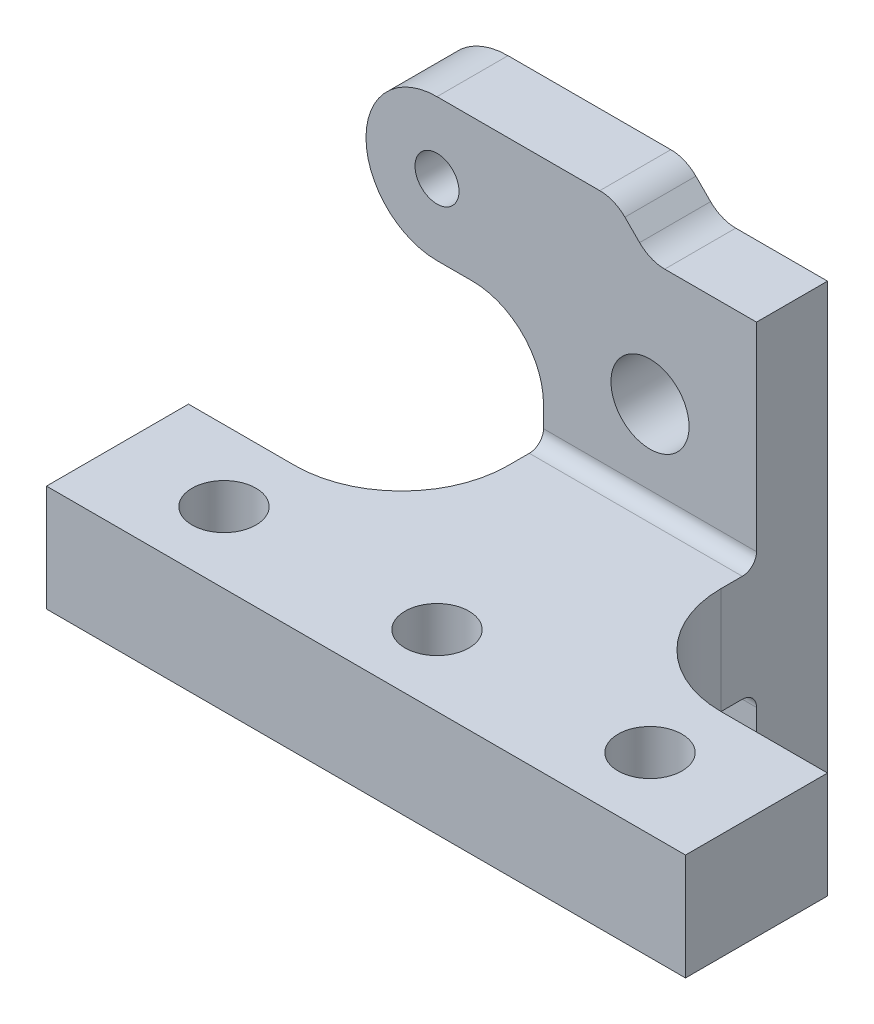
ISO-10303-21;
HEADER;
FILE_DESCRIPTION(('STEP AP214'),'2;1');
FILE_NAME('part.step','',(''),(''),'','','');
FILE_SCHEMA(('AUTOMOTIVE_DESIGN { 1 0 10303 214 1 1 1 1 }'));
ENDSEC;
DATA;
#1=APPLICATION_CONTEXT('core data for automotive mechanical design processes');
#2=APPLICATION_PROTOCOL_DEFINITION('international standard','automotive_design',2000,#1);
#3=PRODUCT_CONTEXT('',#1,'mechanical');
#4=PRODUCT('Part','Part','',(#3));
#5=PRODUCT_RELATED_PRODUCT_CATEGORY('part','',(#4));
#6=PRODUCT_DEFINITION_FORMATION('','',#4);
#7=PRODUCT_DEFINITION_CONTEXT('part definition',#1,'design');
#8=PRODUCT_DEFINITION('design','',#6,#7);
#9=PRODUCT_DEFINITION_SHAPE('','',#8);
#10=(LENGTH_UNIT() NAMED_UNIT(*) SI_UNIT(.MILLI.,.METRE.));
#11=(NAMED_UNIT(*) PLANE_ANGLE_UNIT() SI_UNIT($,.RADIAN.));
#12=(NAMED_UNIT(*) SI_UNIT($,.STERADIAN.) SOLID_ANGLE_UNIT());
#13=UNCERTAINTY_MEASURE_WITH_UNIT(LENGTH_MEASURE(1.E-05),#10,'distance_accuracy_value','');
#14=(GEOMETRIC_REPRESENTATION_CONTEXT(3) GLOBAL_UNCERTAINTY_ASSIGNED_CONTEXT((#13)) GLOBAL_UNIT_ASSIGNED_CONTEXT((#10,
#11,#12)) REPRESENTATION_CONTEXT('',''));
#15=CARTESIAN_POINT('',(0.,0.,0.));
#16=DIRECTION('',(0.,0.,1.));
#17=DIRECTION('',(1.,0.,0.));
#18=AXIS2_PLACEMENT_3D('',#15,#16,#17);
#19=CARTESIAN_POINT('',(-15.,-37.5,10.));
#20=DIRECTION('',(1.,0.,0.));
#21=DIRECTION('',(0.,0.,-1.));
#22=AXIS2_PLACEMENT_3D('',#19,#20,#21);
#23=PLANE('',#22);
#24=DIRECTION('',(0.,-1.,0.));
#25=VECTOR('',#24,1.);
#26=CARTESIAN_POINT('',(-15.,-37.5,10.));
#27=LINE('',#26,#25);
#28=CARTESIAN_POINT('',(-15.,12.5,10.));
#29=VERTEX_POINT('',#28);
#30=CARTESIAN_POINT('',(-15.,9.5,10.));
#31=VERTEX_POINT('',#30);
#32=EDGE_CURVE('E320',#29,#31,#27,.T.);
#33=ORIENTED_EDGE('',*,*,#32,.F.);
#34=DIRECTION('',(0.,0.,1.));
#35=VECTOR('',#34,1.);
#36=CARTESIAN_POINT('',(-15.,12.5,10.));
#37=LINE('',#36,#35);
#38=CARTESIAN_POINT('',(-15.,12.5,0.));
#39=VERTEX_POINT('',#38);
#40=EDGE_CURVE('E55',#29,#39,#37,.F.);
#41=ORIENTED_EDGE('',*,*,#40,.T.);
#42=DIRECTION('',(0.,-1.,0.));
#43=VECTOR('',#42,1.);
#44=CARTESIAN_POINT('',(-15.,-37.5,0.));
#45=LINE('',#44,#43);
#46=CARTESIAN_POINT('',(-15.,-37.5,0.));
#47=VERTEX_POINT('',#46);
#48=EDGE_CURVE('E330',#39,#47,#45,.T.);
#49=ORIENTED_EDGE('',*,*,#48,.T.);
#50=DIRECTION('',(0.,0.,-1.));
#51=VECTOR('',#50,1.);
#52=CARTESIAN_POINT('',(-15.,-37.5,10.));
#53=LINE('',#52,#51);
#54=CARTESIAN_POINT('',(-15.,-37.5,10.));
#55=VERTEX_POINT('',#54);
#56=EDGE_CURVE('E336',#55,#47,#53,.T.);
#57=ORIENTED_EDGE('',*,*,#56,.F.);
#58=CARTESIAN_POINT('',(-15.,-9.5,10.));
#59=VERTEX_POINT('',#58);
#60=EDGE_CURVE('E319',#59,#55,#27,.T.);
#61=ORIENTED_EDGE('',*,*,#60,.F.);
#62=CARTESIAN_POINT('',(-15.,-9.5,12.));
#63=DIRECTION('',(1.,0.,0.));
#64=DIRECTION('',(0.,0.,-1.));
#65=AXIS2_PLACEMENT_3D('',#62,#63,#64);
#66=CIRCLE('',#65,2.);
#67=CARTESIAN_POINT('',(-15.,-7.5,12.));
#68=VERTEX_POINT('',#67);
#69=EDGE_CURVE('E360',#59,#68,#66,.T.);
#70=ORIENTED_EDGE('',*,*,#69,.T.);
#71=DIRECTION('',(0.,0.,-1.));
#72=VECTOR('',#71,1.);
#73=CARTESIAN_POINT('',(-15.,-7.5,50.));
#74=LINE('',#73,#72);
#75=CARTESIAN_POINT('',(-15.,-7.5,15.));
#76=VERTEX_POINT('',#75);
#77=EDGE_CURVE('E293',#76,#68,#74,.T.);
#78=ORIENTED_EDGE('',*,*,#77,.F.);
#79=DIRECTION('',(0.,-1.,0.));
#80=VECTOR('',#79,1.);
#81=CARTESIAN_POINT('',(-15.,7.5,15.));
#82=LINE('',#81,#80);
#83=CARTESIAN_POINT('',(-15.,7.5,15.));
#84=VERTEX_POINT('',#83);
#85=EDGE_CURVE('E375',#76,#84,#82,.F.);
#86=ORIENTED_EDGE('',*,*,#85,.T.);
#87=DIRECTION('',(0.,0.,-1.));
#88=VECTOR('',#87,1.);
#89=CARTESIAN_POINT('',(-15.,7.5,50.));
#90=LINE('',#89,#88);
#91=CARTESIAN_POINT('',(-15.,7.5,12.));
#92=VERTEX_POINT('',#91);
#93=EDGE_CURVE('E295',#84,#92,#90,.T.);
#94=ORIENTED_EDGE('',*,*,#93,.T.);
#95=CARTESIAN_POINT('',(-15.,9.5,12.));
#96=DIRECTION('',(1.,0.,0.));
#97=DIRECTION('',(0.,0.,-1.));
#98=AXIS2_PLACEMENT_3D('',#95,#96,#97);
#99=CIRCLE('',#98,2.);
#100=EDGE_CURVE('E352',#92,#31,#99,.T.);
#101=ORIENTED_EDGE('',*,*,#100,.T.);
#102=EDGE_LOOP('',(#33,#41,#49,#57,#61,#70,#78,#86,#94,#101));
#103=FACE_BOUND('',#102,.T.);
#104=ADVANCED_FACE('F40',(#103),#23,.F.);
#105=CARTESIAN_POINT('',(15.,-37.5,10.));
#106=DIRECTION('',(-1.,0.,0.));
#107=DIRECTION('',(0.,0.,1.));
#108=AXIS2_PLACEMENT_3D('',#105,#106,#107);
#109=PLANE('',#108);
#110=DIRECTION('',(0.,0.,-1.));
#111=VECTOR('',#110,1.);
#112=CARTESIAN_POINT('',(15.,7.5,50.));
#113=LINE('',#112,#111);
#114=CARTESIAN_POINT('',(15.,7.5,15.));
#115=VERTEX_POINT('',#114);
#116=CARTESIAN_POINT('',(15.,7.5,12.));
#117=VERTEX_POINT('',#116);
#118=EDGE_CURVE('E297',#115,#117,#113,.T.);
#119=ORIENTED_EDGE('',*,*,#118,.F.);
#120=DIRECTION('',(0.,1.,0.));
#121=VECTOR('',#120,1.);
#122=CARTESIAN_POINT('',(15.,-7.5,15.));
#123=LINE('',#122,#121);
#124=CARTESIAN_POINT('',(15.,-7.5,15.));
#125=VERTEX_POINT('',#124);
#126=EDGE_CURVE('E366',#115,#125,#123,.F.);
#127=ORIENTED_EDGE('',*,*,#126,.T.);
#128=DIRECTION('',(0.,0.,-1.));
#129=VECTOR('',#128,1.);
#130=CARTESIAN_POINT('',(15.,-7.5,50.));
#131=LINE('',#130,#129);
#132=CARTESIAN_POINT('',(15.,-7.5,12.));
#133=VERTEX_POINT('',#132);
#134=EDGE_CURVE('E291',#125,#133,#131,.T.);
#135=ORIENTED_EDGE('',*,*,#134,.T.);
#136=CARTESIAN_POINT('',(15.,-9.5,12.));
#137=DIRECTION('',(-1.,0.,0.));
#138=DIRECTION('',(0.,0.,1.));
#139=AXIS2_PLACEMENT_3D('',#136,#137,#138);
#140=CIRCLE('',#139,2.);
#141=CARTESIAN_POINT('',(15.,-9.5,10.));
#142=VERTEX_POINT('',#141);
#143=EDGE_CURVE('E358',#133,#142,#140,.T.);
#144=ORIENTED_EDGE('',*,*,#143,.T.);
#145=DIRECTION('',(0.,1.,0.));
#146=VECTOR('',#145,1.);
#147=CARTESIAN_POINT('',(15.,-37.5,10.));
#148=LINE('',#147,#146);
#149=CARTESIAN_POINT('',(15.,-37.5,10.));
#150=VERTEX_POINT('',#149);
#151=EDGE_CURVE('E312',#150,#142,#148,.T.);
#152=ORIENTED_EDGE('',*,*,#151,.F.);
#153=DIRECTION('',(0.,0.,-1.));
#154=VECTOR('',#153,1.);
#155=CARTESIAN_POINT('',(15.,-37.5,10.));
#156=LINE('',#155,#154);
#157=CARTESIAN_POINT('',(15.,-37.5,0.));
#158=VERTEX_POINT('',#157);
#159=EDGE_CURVE('E324',#150,#158,#156,.T.);
#160=ORIENTED_EDGE('',*,*,#159,.T.);
#161=DIRECTION('',(0.,1.,0.));
#162=VECTOR('',#161,1.);
#163=CARTESIAN_POINT('',(15.,-37.5,0.));
#164=LINE('',#163,#162);
#165=CARTESIAN_POINT('',(15.,37.5,0.));
#166=VERTEX_POINT('',#165);
#167=EDGE_CURVE('E309',#158,#166,#164,.T.);
#168=ORIENTED_EDGE('',*,*,#167,.T.);
#169=DIRECTION('',(0.,0.,-1.));
#170=VECTOR('',#169,1.);
#171=CARTESIAN_POINT('',(15.,37.5,10.));
#172=LINE('',#171,#170);
#173=CARTESIAN_POINT('',(15.,37.5,10.));
#174=VERTEX_POINT('',#173);
#175=EDGE_CURVE('E339',#174,#166,#172,.T.);
#176=ORIENTED_EDGE('',*,*,#175,.F.);
#177=CARTESIAN_POINT('',(15.,9.5,10.));
#178=VERTEX_POINT('',#177);
#179=EDGE_CURVE('E316',#178,#174,#148,.T.);
#180=ORIENTED_EDGE('',*,*,#179,.F.);
#181=CARTESIAN_POINT('',(15.,9.5,12.));
#182=DIRECTION('',(-1.,0.,0.));
#183=DIRECTION('',(0.,0.,1.));
#184=AXIS2_PLACEMENT_3D('',#181,#182,#183);
#185=CIRCLE('',#184,2.);
#186=EDGE_CURVE('E355',#178,#117,#185,.T.);
#187=ORIENTED_EDGE('',*,*,#186,.T.);
#188=EDGE_LOOP('',(#119,#127,#135,#144,#152,#160,#168,#176,#180,#187));
#189=FACE_BOUND('',#188,.T.);
#190=ADVANCED_FACE('F429',(#189),#109,.F.);
#191=CARTESIAN_POINT('',(0.,0.,10.));
#192=DIRECTION('',(0.,0.,-1.));
#193=DIRECTION('',(-1.,0.,0.));
#194=AXIS2_PLACEMENT_3D('',#191,#192,#193);
#195=PLANE('',#194);
#196=CARTESIAN_POINT('',(0.,-20.,10.));
#197=DIRECTION('',(0.,0.,1.));
#198=DIRECTION('',(1.,0.,0.));
#199=AXIS2_PLACEMENT_3D('',#196,#197,#198);
#200=CIRCLE('',#199,5.5);
#201=CARTESIAN_POINT('',(5.5,-20.,10.));
#202=VERTEX_POINT('',#201);
#203=EDGE_CURVE('E300',#202,#202,#200,.T.);
#204=ORIENTED_EDGE('',*,*,#203,.F.);
#205=EDGE_LOOP('',(#204));
#206=FACE_BOUND('',#205,.T.);
#207=ORIENTED_EDGE('',*,*,#151,.T.);
#208=DIRECTION('',(1.,0.,0.));
#209=VECTOR('',#208,1.);
#210=CARTESIAN_POINT('',(-15.,-9.5,10.));
#211=LINE('',#210,#209);
#212=EDGE_CURVE('E350',#142,#59,#211,.F.);
#213=ORIENTED_EDGE('',*,*,#212,.T.);
#214=ORIENTED_EDGE('',*,*,#60,.T.);
#215=DIRECTION('',(1.,0.,0.));
#216=VECTOR('',#215,1.);
#217=CARTESIAN_POINT('',(-15.,-37.5,10.));
#218=LINE('',#217,#216);
#219=EDGE_CURVE('E322',#55,#150,#218,.T.);
#220=ORIENTED_EDGE('',*,*,#219,.T.);
#221=EDGE_LOOP('',(#207,#213,#214,#220));
#222=FACE_BOUND('',#221,.T.);
#223=ADVANCED_FACE('F452',(#206,#222),#195,.F.);
#224=CARTESIAN_POINT('',(-30.,32.5,10.));
#225=DIRECTION('',(0.,0.,1.));
#226=DIRECTION('',(1.,0.,0.));
#227=AXIS2_PLACEMENT_3D('',#224,#225,#226);
#228=CIRCLE('',#227,3.1);
#229=CARTESIAN_POINT('',(-26.9,32.5,10.));
#230=VERTEX_POINT('',#229);
#231=EDGE_CURVE('E224',#230,#230,#228,.T.);
#232=ORIENTED_EDGE('',*,*,#231,.F.);
#233=EDGE_LOOP('',(#232));
#234=FACE_BOUND('',#233,.T.);
#235=DIRECTION('',(-0.707106781186547,0.707106781186548,0.));
#236=VECTOR('',#235,1.);
#237=CARTESIAN_POINT('',(-5.00000000000002,42.5,10.));
#238=LINE('',#237,#236);
#239=CARTESIAN_POINT('',(-1.46446609406725,38.9644660940673,10.));
#240=VERTEX_POINT('',#239);
#241=CARTESIAN_POINT('',(-3.53553390593276,41.0355339059328,10.));
#242=VERTEX_POINT('',#241);
#243=EDGE_CURVE('E221',#240,#242,#238,.T.);
#244=ORIENTED_EDGE('',*,*,#243,.T.);
#245=CARTESIAN_POINT('',(-7.0710678118655,37.5,10.));
#246=DIRECTION('',(0.,0.,-1.));
#247=DIRECTION('',(-1.,0.,0.));
#248=AXIS2_PLACEMENT_3D('',#245,#246,#247);
#249=CIRCLE('',#248,5.);
#250=CARTESIAN_POINT('',(-7.0710678118655,42.5,10.));
#251=VERTEX_POINT('',#250);
#252=EDGE_CURVE('E386',#242,#251,#249,.F.);
#253=ORIENTED_EDGE('',*,*,#252,.T.);
#254=DIRECTION('',(-1.,0.,0.));
#255=VECTOR('',#254,1.);
#256=CARTESIAN_POINT('',(-30.,42.5,10.));
#257=LINE('',#256,#255);
#258=CARTESIAN_POINT('',(-30.,42.5,10.));
#259=VERTEX_POINT('',#258);
#260=EDGE_CURVE('E219',#251,#259,#257,.T.);
#261=ORIENTED_EDGE('',*,*,#260,.T.);
#262=CARTESIAN_POINT('',(-30.,32.5,10.));
#263=DIRECTION('',(0.,0.,1.));
#264=DIRECTION('',(1.,0.,0.));
#265=AXIS2_PLACEMENT_3D('',#262,#263,#264);
#266=CIRCLE('',#265,10.);
#267=CARTESIAN_POINT('',(-30.,22.5,10.));
#268=VERTEX_POINT('',#267);
#269=EDGE_CURVE('E230',#259,#268,#266,.T.);
#270=ORIENTED_EDGE('',*,*,#269,.T.);
#271=DIRECTION('',(1.,0.,0.));
#272=VECTOR('',#271,1.);
#273=CARTESIAN_POINT('',(-30.,22.5,10.));
#274=LINE('',#273,#272);
#275=CARTESIAN_POINT('',(-25.,22.5,10.));
#276=VERTEX_POINT('',#275);
#277=EDGE_CURVE('E199',#268,#276,#274,.T.);
#278=ORIENTED_EDGE('',*,*,#277,.T.);
#279=CARTESIAN_POINT('',(-25.,12.5,10.));
#280=DIRECTION('',(0.,0.,-1.));
#281=DIRECTION('',(-1.,0.,0.));
#282=AXIS2_PLACEMENT_3D('',#279,#280,#281);
#283=CIRCLE('',#282,10.);
#284=EDGE_CURVE('E48',#276,#29,#283,.T.);
#285=ORIENTED_EDGE('',*,*,#284,.T.);
#286=ORIENTED_EDGE('',*,*,#32,.T.);
#287=DIRECTION('',(-1.,0.,0.));
#288=VECTOR('',#287,1.);
#289=CARTESIAN_POINT('',(15.,9.5,10.));
#290=LINE('',#289,#288);
#291=EDGE_CURVE('E345',#31,#178,#290,.F.);
#292=ORIENTED_EDGE('',*,*,#291,.T.);
#293=ORIENTED_EDGE('',*,*,#179,.T.);
#294=DIRECTION('',(-1.,0.,0.));
#295=VECTOR('',#294,1.);
#296=CARTESIAN_POINT('',(-15.,37.5,10.));
#297=LINE('',#296,#295);
#298=CARTESIAN_POINT('',(2.07106781186548,37.5,10.));
#299=VERTEX_POINT('',#298);
#300=EDGE_CURVE('E315',#174,#299,#297,.T.);
#301=ORIENTED_EDGE('',*,*,#300,.T.);
#302=CARTESIAN_POINT('',(2.07106781186548,42.5,10.));
#303=DIRECTION('',(0.,0.,-1.));
#304=DIRECTION('',(-1.,0.,0.));
#305=AXIS2_PLACEMENT_3D('',#302,#303,#304);
#306=CIRCLE('',#305,5.);
#307=EDGE_CURVE('E395',#299,#240,#306,.T.);
#308=ORIENTED_EDGE('',*,*,#307,.T.);
#309=EDGE_LOOP('',(#244,#253,#261,#270,#278,#285,#286,#292,#293,#301,#308));
#310=FACE_BOUND('',#309,.T.);
#311=CARTESIAN_POINT('',(0.,20.,10.));
#312=DIRECTION('',(0.,0.,1.));
#313=DIRECTION('',(1.,0.,0.));
#314=AXIS2_PLACEMENT_3D('',#311,#312,#313);
#315=CIRCLE('',#314,5.5);
#316=CARTESIAN_POINT('',(5.5,20.,10.));
#317=VERTEX_POINT('',#316);
#318=EDGE_CURVE('E306',#317,#317,#315,.T.);
#319=ORIENTED_EDGE('',*,*,#318,.F.);
#320=EDGE_LOOP('',(#319));
#321=FACE_BOUND('',#320,.T.);
#322=ADVANCED_FACE('F402',(#234,#310,#321),#195,.F.);
#323=CARTESIAN_POINT('',(0.,0.,0.));
#324=DIRECTION('',(0.,0.,-1.));
#325=DIRECTION('',(-1.,0.,0.));
#326=AXIS2_PLACEMENT_3D('',#323,#324,#325);
#327=PLANE('',#326);
#328=CARTESIAN_POINT('',(-30.,32.5,0.));
#329=DIRECTION('',(0.,0.,1.));
#330=DIRECTION('',(1.,0.,0.));
#331=AXIS2_PLACEMENT_3D('',#328,#329,#330);
#332=CIRCLE('',#331,3.1);
#333=CARTESIAN_POINT('',(-26.9,32.5,0.));
#334=VERTEX_POINT('',#333);
#335=EDGE_CURVE('E232',#334,#334,#332,.T.);
#336=ORIENTED_EDGE('',*,*,#335,.T.);
#337=EDGE_LOOP('',(#336));
#338=FACE_BOUND('',#337,.T.);
#339=DIRECTION('',(-1.,0.,0.));
#340=VECTOR('',#339,1.);
#341=CARTESIAN_POINT('',(-30.,42.5,0.));
#342=LINE('',#341,#340);
#343=CARTESIAN_POINT('',(-7.0710678118655,42.5,0.));
#344=VERTEX_POINT('',#343);
#345=CARTESIAN_POINT('',(-30.,42.5,0.));
#346=VERTEX_POINT('',#345);
#347=EDGE_CURVE('E205',#344,#346,#342,.T.);
#348=ORIENTED_EDGE('',*,*,#347,.F.);
#349=CARTESIAN_POINT('',(-7.0710678118655,37.5,0.));
#350=DIRECTION('',(0.,0.,-1.));
#351=DIRECTION('',(-1.,0.,0.));
#352=AXIS2_PLACEMENT_3D('',#349,#350,#351);
#353=CIRCLE('',#352,5.);
#354=CARTESIAN_POINT('',(-3.53553390593276,41.0355339059328,0.));
#355=VERTEX_POINT('',#354);
#356=EDGE_CURVE('E390',#344,#355,#353,.T.);
#357=ORIENTED_EDGE('',*,*,#356,.T.);
#358=DIRECTION('',(-0.707106781186547,0.707106781186548,0.));
#359=VECTOR('',#358,1.);
#360=CARTESIAN_POINT('',(-5.00000000000002,42.5,0.));
#361=LINE('',#360,#359);
#362=CARTESIAN_POINT('',(-1.46446609406725,38.9644660940673,0.));
#363=VERTEX_POINT('',#362);
#364=EDGE_CURVE('E214',#363,#355,#361,.T.);
#365=ORIENTED_EDGE('',*,*,#364,.F.);
#366=CARTESIAN_POINT('',(2.07106781186548,42.5,0.));
#367=DIRECTION('',(0.,0.,-1.));
#368=DIRECTION('',(-1.,0.,0.));
#369=AXIS2_PLACEMENT_3D('',#366,#367,#368);
#370=CIRCLE('',#369,5.);
#371=CARTESIAN_POINT('',(2.07106781186548,37.5,0.));
#372=VERTEX_POINT('',#371);
#373=EDGE_CURVE('E397',#363,#372,#370,.F.);
#374=ORIENTED_EDGE('',*,*,#373,.T.);
#375=DIRECTION('',(-1.,0.,0.));
#376=VECTOR('',#375,1.);
#377=CARTESIAN_POINT('',(-15.,37.5,0.));
#378=LINE('',#377,#376);
#379=EDGE_CURVE('E327',#166,#372,#378,.T.);
#380=ORIENTED_EDGE('',*,*,#379,.F.);
#381=ORIENTED_EDGE('',*,*,#167,.F.);
#382=DIRECTION('',(1.,0.,0.));
#383=VECTOR('',#382,1.);
#384=CARTESIAN_POINT('',(-15.,-37.5,0.));
#385=LINE('',#384,#383);
#386=EDGE_CURVE('E332',#47,#158,#385,.T.);
#387=ORIENTED_EDGE('',*,*,#386,.F.);
#388=ORIENTED_EDGE('',*,*,#48,.F.);
#389=CARTESIAN_POINT('',(-25.,12.5,0.));
#390=DIRECTION('',(0.,0.,-1.));
#391=DIRECTION('',(-1.,0.,0.));
#392=AXIS2_PLACEMENT_3D('',#389,#390,#391);
#393=CIRCLE('',#392,10.);
#394=CARTESIAN_POINT('',(-25.,22.5,0.));
#395=VERTEX_POINT('',#394);
#396=EDGE_CURVE('E11',#39,#395,#393,.F.);
#397=ORIENTED_EDGE('',*,*,#396,.T.);
#398=DIRECTION('',(1.,0.,0.));
#399=VECTOR('',#398,1.);
#400=CARTESIAN_POINT('',(-30.,22.5,0.));
#401=LINE('',#400,#399);
#402=CARTESIAN_POINT('',(-30.,22.5,0.));
#403=VERTEX_POINT('',#402);
#404=EDGE_CURVE('E197',#403,#395,#401,.T.);
#405=ORIENTED_EDGE('',*,*,#404,.F.);
#406=CARTESIAN_POINT('',(-30.,32.5,0.));
#407=DIRECTION('',(0.,0.,1.));
#408=DIRECTION('',(1.,0.,0.));
#409=AXIS2_PLACEMENT_3D('',#406,#407,#408);
#410=CIRCLE('',#409,10.);
#411=EDGE_CURVE('E212',#346,#403,#410,.T.);
#412=ORIENTED_EDGE('',*,*,#411,.F.);
#413=EDGE_LOOP('',(#348,#357,#365,#374,#380,#381,#387,#388,#397,#405,#412));
#414=FACE_BOUND('',#413,.T.);
#415=CARTESIAN_POINT('',(0.,20.,0.));
#416=DIRECTION('',(0.,0.,1.));
#417=DIRECTION('',(1.,0.,0.));
#418=AXIS2_PLACEMENT_3D('',#415,#416,#417);
#419=CIRCLE('',#418,5.5);
#420=CARTESIAN_POINT('',(5.5,20.,0.));
#421=VERTEX_POINT('',#420);
#422=EDGE_CURVE('E303',#421,#421,#419,.T.);
#423=ORIENTED_EDGE('',*,*,#422,.T.);
#424=EDGE_LOOP('',(#423));
#425=FACE_BOUND('',#424,.T.);
#426=CARTESIAN_POINT('',(0.,-20.,0.));
#427=DIRECTION('',(0.,0.,1.));
#428=DIRECTION('',(1.,0.,0.));
#429=AXIS2_PLACEMENT_3D('',#426,#427,#428);
#430=CIRCLE('',#429,5.5);
#431=CARTESIAN_POINT('',(5.5,-20.,0.));
#432=VERTEX_POINT('',#431);
#433=EDGE_CURVE('E299',#432,#432,#430,.T.);
#434=ORIENTED_EDGE('',*,*,#433,.T.);
#435=EDGE_LOOP('',(#434));
#436=FACE_BOUND('',#435,.T.);
#437=ADVANCED_FACE('F210',(#338,#414,#425,#436),#327,.T.);
#438=CARTESIAN_POINT('',(-15.,37.5,10.));
#439=DIRECTION('',(0.,-1.,0.));
#440=DIRECTION('',(0.,0.,-1.));
#441=AXIS2_PLACEMENT_3D('',#438,#439,#440);
#442=PLANE('',#441);
#443=ORIENTED_EDGE('',*,*,#379,.T.);
#444=DIRECTION('',(0.,0.,1.));
#445=VECTOR('',#444,1.);
#446=CARTESIAN_POINT('',(2.07106781186548,37.5,10.));
#447=LINE('',#446,#445);
#448=EDGE_CURVE('E392',#372,#299,#447,.T.);
#449=ORIENTED_EDGE('',*,*,#448,.T.);
#450=ORIENTED_EDGE('',*,*,#300,.F.);
#451=ORIENTED_EDGE('',*,*,#175,.T.);
#452=EDGE_LOOP('',(#443,#449,#450,#451));
#453=FACE_BOUND('',#452,.T.);
#454=ADVANCED_FACE('F423',(#453),#442,.F.);
#455=CARTESIAN_POINT('',(-15.,-37.5,10.));
#456=DIRECTION('',(0.,1.,0.));
#457=DIRECTION('',(0.,0.,1.));
#458=AXIS2_PLACEMENT_3D('',#455,#456,#457);
#459=PLANE('',#458);
#460=ORIENTED_EDGE('',*,*,#386,.T.);
#461=ORIENTED_EDGE('',*,*,#159,.F.);
#462=ORIENTED_EDGE('',*,*,#219,.F.);
#463=ORIENTED_EDGE('',*,*,#56,.T.);
#464=EDGE_LOOP('',(#460,#461,#462,#463));
#465=FACE_BOUND('',#464,.T.);
#466=ADVANCED_FACE('F435',(#465),#459,.F.);
#467=CARTESIAN_POINT('',(0.,20.,10.));
#468=DIRECTION('',(0.,0.,-1.));
#469=DIRECTION('',(-1.,0.,0.));
#470=AXIS2_PLACEMENT_3D('',#467,#468,#469);
#471=CYLINDRICAL_SURFACE('',#470,5.5);
#472=ORIENTED_EDGE('',*,*,#318,.T.);
#473=EDGE_LOOP('',(#472));
#474=FACE_BOUND('',#473,.T.);
#475=ORIENTED_EDGE('',*,*,#422,.F.);
#476=EDGE_LOOP('',(#475));
#477=FACE_BOUND('',#476,.T.);
#478=ADVANCED_FACE('F531',(#474,#477),#471,.F.);
#479=CARTESIAN_POINT('',(0.,-20.,10.));
#480=DIRECTION('',(0.,0.,-1.));
#481=DIRECTION('',(-1.,0.,0.));
#482=AXIS2_PLACEMENT_3D('',#479,#480,#481);
#483=CYLINDRICAL_SURFACE('',#482,5.5);
#484=ORIENTED_EDGE('',*,*,#203,.T.);
#485=EDGE_LOOP('',(#484));
#486=FACE_BOUND('',#485,.T.);
#487=ORIENTED_EDGE('',*,*,#433,.F.);
#488=EDGE_LOOP('',(#487));
#489=FACE_BOUND('',#488,.T.);
#490=ADVANCED_FACE('F527',(#486,#489),#483,.F.);
#491=CARTESIAN_POINT('',(-15.,7.5,50.));
#492=DIRECTION('',(0.,-1.,0.));
#493=DIRECTION('',(0.,0.,-1.));
#494=AXIS2_PLACEMENT_3D('',#491,#492,#493);
#495=PLANE('',#494);
#496=CARTESIAN_POINT('',(-30.,7.5,40.));
#497=DIRECTION('',(0.,-1.,0.));
#498=DIRECTION('',(0.,0.,-1.));
#499=AXIS2_PLACEMENT_3D('',#496,#497,#498);
#500=CIRCLE('',#499,4.5);
#501=CARTESIAN_POINT('',(-30.,7.5,35.5));
#502=VERTEX_POINT('',#501);
#503=EDGE_CURVE('E240',#502,#502,#500,.T.);
#504=ORIENTED_EDGE('',*,*,#503,.T.);
#505=EDGE_LOOP('',(#504));
#506=FACE_BOUND('',#505,.T.);
#507=CARTESIAN_POINT('',(30.,7.5,40.));
#508=DIRECTION('',(0.,-1.,0.));
#509=DIRECTION('',(0.,0.,-1.));
#510=AXIS2_PLACEMENT_3D('',#507,#508,#509);
#511=CIRCLE('',#510,4.5);
#512=CARTESIAN_POINT('',(30.,7.5,35.5));
#513=VERTEX_POINT('',#512);
#514=EDGE_CURVE('E262',#513,#513,#511,.T.);
#515=ORIENTED_EDGE('',*,*,#514,.T.);
#516=EDGE_LOOP('',(#515));
#517=FACE_BOUND('',#516,.T.);
#518=CARTESIAN_POINT('',(0.,7.5,40.));
#519=DIRECTION('',(0.,-1.,0.));
#520=DIRECTION('',(0.,0.,-1.));
#521=AXIS2_PLACEMENT_3D('',#518,#519,#520);
#522=CIRCLE('',#521,4.5);
#523=CARTESIAN_POINT('',(0.,7.5,35.5));
#524=VERTEX_POINT('',#523);
#525=EDGE_CURVE('E282',#524,#524,#522,.T.);
#526=ORIENTED_EDGE('',*,*,#525,.T.);
#527=EDGE_LOOP('',(#526));
#528=FACE_BOUND('',#527,.T.);
#529=DIRECTION('',(-1.,0.,0.));
#530=VECTOR('',#529,1.);
#531=CARTESIAN_POINT('',(-15.,7.5,50.));
#532=LINE('',#531,#530);
#533=CARTESIAN_POINT('',(45.,7.5,50.));
#534=VERTEX_POINT('',#533);
#535=CARTESIAN_POINT('',(-45.,7.5,50.));
#536=VERTEX_POINT('',#535);
#537=EDGE_CURVE('E285',#534,#536,#532,.T.);
#538=ORIENTED_EDGE('',*,*,#537,.F.);
#539=DIRECTION('',(0.,0.,1.));
#540=VECTOR('',#539,1.);
#541=CARTESIAN_POINT('',(45.,7.5,50.));
#542=LINE('',#541,#540);
#543=CARTESIAN_POINT('',(45.,7.5,30.));
#544=VERTEX_POINT('',#543);
#545=EDGE_CURVE('E272',#544,#534,#542,.T.);
#546=ORIENTED_EDGE('',*,*,#545,.F.);
#547=DIRECTION('',(-1.,0.,0.));
#548=VECTOR('',#547,1.);
#549=CARTESIAN_POINT('',(45.,7.5,30.));
#550=LINE('',#549,#548);
#551=CARTESIAN_POINT('',(30.,7.5,30.));
#552=VERTEX_POINT('',#551);
#553=EDGE_CURVE('E275',#544,#552,#550,.T.);
#554=ORIENTED_EDGE('',*,*,#553,.T.);
#555=CARTESIAN_POINT('',(30.,7.5,15.));
#556=DIRECTION('',(0.,-1.,0.));
#557=DIRECTION('',(0.,0.,-1.));
#558=AXIS2_PLACEMENT_3D('',#555,#556,#557);
#559=CIRCLE('',#558,15.);
#560=EDGE_CURVE('E368',#552,#115,#559,.T.);
#561=ORIENTED_EDGE('',*,*,#560,.T.);
#562=ORIENTED_EDGE('',*,*,#118,.T.);
#563=DIRECTION('',(-1.,0.,0.));
#564=VECTOR('',#563,1.);
#565=CARTESIAN_POINT('',(-15.,7.5,12.));
#566=LINE('',#565,#564);
#567=EDGE_CURVE('E342',#117,#92,#566,.T.);
#568=ORIENTED_EDGE('',*,*,#567,.T.);
#569=ORIENTED_EDGE('',*,*,#93,.F.);
#570=CARTESIAN_POINT('',(-30.,7.5,15.));
#571=DIRECTION('',(0.,-1.,0.));
#572=DIRECTION('',(0.,0.,-1.));
#573=AXIS2_PLACEMENT_3D('',#570,#571,#572);
#574=CIRCLE('',#573,15.);
#575=CARTESIAN_POINT('',(-30.,7.5,30.));
#576=VERTEX_POINT('',#575);
#577=EDGE_CURVE('E379',#84,#576,#574,.T.);
#578=ORIENTED_EDGE('',*,*,#577,.T.);
#579=DIRECTION('',(1.,0.,0.));
#580=VECTOR('',#579,1.);
#581=CARTESIAN_POINT('',(-45.,7.5,30.));
#582=LINE('',#581,#580);
#583=CARTESIAN_POINT('',(-45.,7.5,30.));
#584=VERTEX_POINT('',#583);
#585=EDGE_CURVE('E256',#584,#576,#582,.T.);
#586=ORIENTED_EDGE('',*,*,#585,.F.);
#587=DIRECTION('',(0.,0.,-1.));
#588=VECTOR('',#587,1.);
#589=CARTESIAN_POINT('',(-45.,7.5,50.));
#590=LINE('',#589,#588);
#591=EDGE_CURVE('E246',#536,#584,#590,.T.);
#592=ORIENTED_EDGE('',*,*,#591,.F.);
#593=EDGE_LOOP('',(#538,#546,#554,#561,#562,#568,#569,#578,#586,#592));
#594=FACE_BOUND('',#593,.T.);
#595=ADVANCED_FACE('F523',(#506,#517,#528,#594),#495,.F.);
#596=CARTESIAN_POINT('',(-15.,-7.5,50.));
#597=DIRECTION('',(0.,1.,0.));
#598=DIRECTION('',(0.,0.,1.));
#599=AXIS2_PLACEMENT_3D('',#596,#597,#598);
#600=PLANE('',#599);
#601=CARTESIAN_POINT('',(-30.,-7.5,40.));
#602=DIRECTION('',(0.,-1.,0.));
#603=DIRECTION('',(0.,0.,-1.));
#604=AXIS2_PLACEMENT_3D('',#601,#602,#603);
#605=CIRCLE('',#604,4.5);
#606=CARTESIAN_POINT('',(-30.,-7.5,35.5));
#607=VERTEX_POINT('',#606);
#608=EDGE_CURVE('E236',#607,#607,#605,.T.);
#609=ORIENTED_EDGE('',*,*,#608,.F.);
#610=EDGE_LOOP('',(#609));
#611=FACE_BOUND('',#610,.T.);
#612=CARTESIAN_POINT('',(30.,-7.5,40.));
#613=DIRECTION('',(0.,-1.,0.));
#614=DIRECTION('',(0.,0.,-1.));
#615=AXIS2_PLACEMENT_3D('',#612,#613,#614);
#616=CIRCLE('',#615,4.5);
#617=CARTESIAN_POINT('',(30.,-7.5,35.5));
#618=VERTEX_POINT('',#617);
#619=EDGE_CURVE('E259',#618,#618,#616,.T.);
#620=ORIENTED_EDGE('',*,*,#619,.F.);
#621=EDGE_LOOP('',(#620));
#622=FACE_BOUND('',#621,.T.);
#623=CARTESIAN_POINT('',(0.,-7.5,40.));
#624=DIRECTION('',(0.,-1.,0.));
#625=DIRECTION('',(0.,0.,-1.));
#626=AXIS2_PLACEMENT_3D('',#623,#624,#625);
#627=CIRCLE('',#626,4.5);
#628=CARTESIAN_POINT('',(0.,-7.5,35.5));
#629=VERTEX_POINT('',#628);
#630=EDGE_CURVE('E281',#629,#629,#627,.T.);
#631=ORIENTED_EDGE('',*,*,#630,.F.);
#632=EDGE_LOOP('',(#631));
#633=FACE_BOUND('',#632,.T.);
#634=DIRECTION('',(1.,0.,0.));
#635=VECTOR('',#634,1.);
#636=CARTESIAN_POINT('',(-15.,-7.5,50.));
#637=LINE('',#636,#635);
#638=CARTESIAN_POINT('',(-45.,-7.5,50.));
#639=VERTEX_POINT('',#638);
#640=CARTESIAN_POINT('',(45.,-7.5,50.));
#641=VERTEX_POINT('',#640);
#642=EDGE_CURVE('E289',#639,#641,#637,.T.);
#643=ORIENTED_EDGE('',*,*,#642,.F.);
#644=DIRECTION('',(0.,0.,1.));
#645=VECTOR('',#644,1.);
#646=CARTESIAN_POINT('',(-45.,-7.5,50.));
#647=LINE('',#646,#645);
#648=CARTESIAN_POINT('',(-45.,-7.5,30.));
#649=VERTEX_POINT('',#648);
#650=EDGE_CURVE('E250',#649,#639,#647,.T.);
#651=ORIENTED_EDGE('',*,*,#650,.F.);
#652=DIRECTION('',(1.,0.,0.));
#653=VECTOR('',#652,1.);
#654=CARTESIAN_POINT('',(-45.,-7.5,30.));
#655=LINE('',#654,#653);
#656=CARTESIAN_POINT('',(-30.,-7.5,30.));
#657=VERTEX_POINT('',#656);
#658=EDGE_CURVE('E253',#649,#657,#655,.T.);
#659=ORIENTED_EDGE('',*,*,#658,.T.);
#660=CARTESIAN_POINT('',(-30.,-7.5,15.));
#661=DIRECTION('',(0.,1.,0.));
#662=DIRECTION('',(0.,0.,1.));
#663=AXIS2_PLACEMENT_3D('',#660,#661,#662);
#664=CIRCLE('',#663,15.);
#665=EDGE_CURVE('E377',#657,#76,#664,.T.);
#666=ORIENTED_EDGE('',*,*,#665,.T.);
#667=ORIENTED_EDGE('',*,*,#77,.T.);
#668=DIRECTION('',(1.,0.,0.));
#669=VECTOR('',#668,1.);
#670=CARTESIAN_POINT('',(15.,-7.5,12.));
#671=LINE('',#670,#669);
#672=EDGE_CURVE('E347',#68,#133,#671,.T.);
#673=ORIENTED_EDGE('',*,*,#672,.T.);
#674=ORIENTED_EDGE('',*,*,#134,.F.);
#675=CARTESIAN_POINT('',(30.,-7.5,15.));
#676=DIRECTION('',(0.,1.,0.));
#677=DIRECTION('',(0.,0.,1.));
#678=AXIS2_PLACEMENT_3D('',#675,#676,#677);
#679=CIRCLE('',#678,15.);
#680=CARTESIAN_POINT('',(30.,-7.5,30.));
#681=VERTEX_POINT('',#680);
#682=EDGE_CURVE('E370',#125,#681,#679,.T.);
#683=ORIENTED_EDGE('',*,*,#682,.T.);
#684=DIRECTION('',(-1.,0.,0.));
#685=VECTOR('',#684,1.);
#686=CARTESIAN_POINT('',(45.,-7.5,30.));
#687=LINE('',#686,#685);
#688=CARTESIAN_POINT('',(45.,-7.5,30.));
#689=VERTEX_POINT('',#688);
#690=EDGE_CURVE('E278',#689,#681,#687,.T.);
#691=ORIENTED_EDGE('',*,*,#690,.F.);
#692=DIRECTION('',(0.,0.,-1.));
#693=VECTOR('',#692,1.);
#694=CARTESIAN_POINT('',(45.,-7.5,50.));
#695=LINE('',#694,#693);
#696=EDGE_CURVE('E268',#641,#689,#695,.T.);
#697=ORIENTED_EDGE('',*,*,#696,.F.);
#698=EDGE_LOOP('',(#643,#651,#659,#666,#667,#673,#674,#683,#691,#697));
#699=FACE_BOUND('',#698,.T.);
#700=ADVANCED_FACE('F519',(#611,#622,#633,#699),#600,.F.);
#701=CARTESIAN_POINT('',(0.,0.,50.));
#702=DIRECTION('',(0.,0.,1.));
#703=DIRECTION('',(1.,0.,0.));
#704=AXIS2_PLACEMENT_3D('',#701,#702,#703);
#705=PLANE('',#704);
#706=ORIENTED_EDGE('',*,*,#642,.T.);
#707=DIRECTION('',(0.,-1.,0.));
#708=VECTOR('',#707,1.);
#709=CARTESIAN_POINT('',(45.,-7.5,50.));
#710=LINE('',#709,#708);
#711=EDGE_CURVE('E265',#534,#641,#710,.T.);
#712=ORIENTED_EDGE('',*,*,#711,.F.);
#713=ORIENTED_EDGE('',*,*,#537,.T.);
#714=DIRECTION('',(0.,1.,0.));
#715=VECTOR('',#714,1.);
#716=CARTESIAN_POINT('',(-45.,7.5,50.));
#717=LINE('',#716,#715);
#718=EDGE_CURVE('E243',#639,#536,#717,.T.);
#719=ORIENTED_EDGE('',*,*,#718,.F.);
#720=EDGE_LOOP('',(#706,#712,#713,#719));
#721=FACE_BOUND('',#720,.T.);
#722=ADVANCED_FACE('F463',(#721),#705,.T.);
#723=CARTESIAN_POINT('',(-15.,9.5,12.));
#724=DIRECTION('',(1.,0.,0.));
#725=DIRECTION('',(0.,0.,-1.));
#726=AXIS2_PLACEMENT_3D('',#723,#724,#725);
#727=CYLINDRICAL_SURFACE('',#726,2.);
#728=ORIENTED_EDGE('',*,*,#186,.F.);
#729=ORIENTED_EDGE('',*,*,#291,.F.);
#730=ORIENTED_EDGE('',*,*,#100,.F.);
#731=ORIENTED_EDGE('',*,*,#567,.F.);
#732=EDGE_LOOP('',(#728,#729,#730,#731));
#733=FACE_BOUND('',#732,.T.);
#734=ADVANCED_FACE('F459',(#733),#727,.F.);
#735=CARTESIAN_POINT('',(-15.,-9.5,12.));
#736=DIRECTION('',(-1.,0.,0.));
#737=DIRECTION('',(0.,0.,1.));
#738=AXIS2_PLACEMENT_3D('',#735,#736,#737);
#739=CYLINDRICAL_SURFACE('',#738,2.);
#740=ORIENTED_EDGE('',*,*,#69,.F.);
#741=ORIENTED_EDGE('',*,*,#212,.F.);
#742=ORIENTED_EDGE('',*,*,#143,.F.);
#743=ORIENTED_EDGE('',*,*,#672,.F.);
#744=EDGE_LOOP('',(#740,#741,#742,#743));
#745=FACE_BOUND('',#744,.T.);
#746=ADVANCED_FACE('F462',(#745),#739,.F.);
#747=CARTESIAN_POINT('',(0.,7.5,40.));
#748=DIRECTION('',(0.,-1.,0.));
#749=DIRECTION('',(0.,0.,-1.));
#750=AXIS2_PLACEMENT_3D('',#747,#748,#749);
#751=CYLINDRICAL_SURFACE('',#750,4.5);
#752=ORIENTED_EDGE('',*,*,#525,.F.);
#753=EDGE_LOOP('',(#752));
#754=FACE_BOUND('',#753,.T.);
#755=ORIENTED_EDGE('',*,*,#630,.T.);
#756=EDGE_LOOP('',(#755));
#757=FACE_BOUND('',#756,.T.);
#758=ADVANCED_FACE('F467',(#754,#757),#751,.F.);
#759=CARTESIAN_POINT('',(45.,-7.5,30.));
#760=DIRECTION('',(0.,0.,1.));
#761=DIRECTION('',(1.,0.,0.));
#762=AXIS2_PLACEMENT_3D('',#759,#760,#761);
#763=PLANE('',#762);
#764=ORIENTED_EDGE('',*,*,#690,.T.);
#765=DIRECTION('',(0.,1.,0.));
#766=VECTOR('',#765,1.);
#767=CARTESIAN_POINT('',(30.,7.5,30.));
#768=LINE('',#767,#766);
#769=EDGE_CURVE('E363',#681,#552,#768,.T.);
#770=ORIENTED_EDGE('',*,*,#769,.T.);
#771=ORIENTED_EDGE('',*,*,#553,.F.);
#772=DIRECTION('',(0.,1.,0.));
#773=VECTOR('',#772,1.);
#774=CARTESIAN_POINT('',(45.,-7.5,30.));
#775=LINE('',#774,#773);
#776=EDGE_CURVE('E270',#689,#544,#775,.T.);
#777=ORIENTED_EDGE('',*,*,#776,.F.);
#778=EDGE_LOOP('',(#764,#770,#771,#777));
#779=FACE_BOUND('',#778,.T.);
#780=ADVANCED_FACE('F509',(#779),#763,.F.);
#781=CARTESIAN_POINT('',(45.,0.,0.));
#782=DIRECTION('',(-1.,0.,0.));
#783=DIRECTION('',(0.,0.,1.));
#784=AXIS2_PLACEMENT_3D('',#781,#782,#783);
#785=PLANE('',#784);
#786=ORIENTED_EDGE('',*,*,#711,.T.);
#787=ORIENTED_EDGE('',*,*,#696,.T.);
#788=ORIENTED_EDGE('',*,*,#776,.T.);
#789=ORIENTED_EDGE('',*,*,#545,.T.);
#790=EDGE_LOOP('',(#786,#787,#788,#789));
#791=FACE_BOUND('',#790,.T.);
#792=ADVANCED_FACE('F505',(#791),#785,.F.);
#793=CARTESIAN_POINT('',(30.,22.5,40.));
#794=DIRECTION('',(0.,-1.,0.));
#795=DIRECTION('',(0.,0.,-1.));
#796=AXIS2_PLACEMENT_3D('',#793,#794,#795);
#797=CYLINDRICAL_SURFACE('',#796,4.5);
#798=ORIENTED_EDGE('',*,*,#619,.T.);
#799=EDGE_LOOP('',(#798));
#800=FACE_BOUND('',#799,.T.);
#801=ORIENTED_EDGE('',*,*,#514,.F.);
#802=EDGE_LOOP('',(#801));
#803=FACE_BOUND('',#802,.T.);
#804=ADVANCED_FACE('F473',(#800,#803),#797,.F.);
#805=CARTESIAN_POINT('',(30.,-7.5,15.));
#806=DIRECTION('',(0.,-1.,0.));
#807=DIRECTION('',(0.,0.,-1.));
#808=AXIS2_PLACEMENT_3D('',#805,#806,#807);
#809=CYLINDRICAL_SURFACE('',#808,15.);
#810=ORIENTED_EDGE('',*,*,#682,.F.);
#811=ORIENTED_EDGE('',*,*,#126,.F.);
#812=ORIENTED_EDGE('',*,*,#560,.F.);
#813=ORIENTED_EDGE('',*,*,#769,.F.);
#814=EDGE_LOOP('',(#810,#811,#812,#813));
#815=FACE_BOUND('',#814,.T.);
#816=ADVANCED_FACE('F469',(#815),#809,.F.);
#817=CARTESIAN_POINT('',(-45.,7.5,30.));
#818=DIRECTION('',(0.,0.,1.));
#819=DIRECTION('',(1.,0.,0.));
#820=AXIS2_PLACEMENT_3D('',#817,#818,#819);
#821=PLANE('',#820);
#822=ORIENTED_EDGE('',*,*,#585,.T.);
#823=DIRECTION('',(0.,-1.,0.));
#824=VECTOR('',#823,1.);
#825=CARTESIAN_POINT('',(-30.,-7.5,30.));
#826=LINE('',#825,#824);
#827=EDGE_CURVE('E372',#576,#657,#826,.T.);
#828=ORIENTED_EDGE('',*,*,#827,.T.);
#829=ORIENTED_EDGE('',*,*,#658,.F.);
#830=DIRECTION('',(0.,-1.,0.));
#831=VECTOR('',#830,1.);
#832=CARTESIAN_POINT('',(-45.,7.5,30.));
#833=LINE('',#832,#831);
#834=EDGE_CURVE('E248',#584,#649,#833,.T.);
#835=ORIENTED_EDGE('',*,*,#834,.F.);
#836=EDGE_LOOP('',(#822,#828,#829,#835));
#837=FACE_BOUND('',#836,.T.);
#838=ADVANCED_FACE('F472',(#837),#821,.F.);
#839=CARTESIAN_POINT('',(-45.,0.,0.));
#840=DIRECTION('',(1.,0.,0.));
#841=DIRECTION('',(0.,0.,-1.));
#842=AXIS2_PLACEMENT_3D('',#839,#840,#841);
#843=PLANE('',#842);
#844=ORIENTED_EDGE('',*,*,#718,.T.);
#845=ORIENTED_EDGE('',*,*,#591,.T.);
#846=ORIENTED_EDGE('',*,*,#834,.T.);
#847=ORIENTED_EDGE('',*,*,#650,.T.);
#848=EDGE_LOOP('',(#844,#845,#846,#847));
#849=FACE_BOUND('',#848,.T.);
#850=ADVANCED_FACE('F479',(#849),#843,.F.);
#851=CARTESIAN_POINT('',(-30.,7.5,15.));
#852=DIRECTION('',(0.,1.,0.));
#853=DIRECTION('',(0.,0.,1.));
#854=AXIS2_PLACEMENT_3D('',#851,#852,#853);
#855=CYLINDRICAL_SURFACE('',#854,15.);
#856=ORIENTED_EDGE('',*,*,#577,.F.);
#857=ORIENTED_EDGE('',*,*,#85,.F.);
#858=ORIENTED_EDGE('',*,*,#665,.F.);
#859=ORIENTED_EDGE('',*,*,#827,.F.);
#860=EDGE_LOOP('',(#856,#857,#858,#859));
#861=FACE_BOUND('',#860,.T.);
#862=ADVANCED_FACE('F475',(#861),#855,.F.);
#863=CARTESIAN_POINT('',(-30.,22.5,40.));
#864=DIRECTION('',(0.,-1.,0.));
#865=DIRECTION('',(0.,0.,-1.));
#866=AXIS2_PLACEMENT_3D('',#863,#864,#865);
#867=CYLINDRICAL_SURFACE('',#866,4.5);
#868=ORIENTED_EDGE('',*,*,#608,.T.);
#869=EDGE_LOOP('',(#868));
#870=FACE_BOUND('',#869,.T.);
#871=ORIENTED_EDGE('',*,*,#503,.F.);
#872=EDGE_LOOP('',(#871));
#873=FACE_BOUND('',#872,.T.);
#874=ADVANCED_FACE('F478',(#870,#873),#867,.F.);
#875=CARTESIAN_POINT('',(-30.,32.5,0.));
#876=DIRECTION('',(0.,0.,1.));
#877=DIRECTION('',(1.,0.,0.));
#878=AXIS2_PLACEMENT_3D('',#875,#876,#877);
#879=CYLINDRICAL_SURFACE('',#878,10.);
#880=ORIENTED_EDGE('',*,*,#269,.F.);
#881=DIRECTION('',(0.,0.,1.));
#882=VECTOR('',#881,1.);
#883=CARTESIAN_POINT('',(-30.,42.5,0.));
#884=LINE('',#883,#882);
#885=EDGE_CURVE('E204',#346,#259,#884,.T.);
#886=ORIENTED_EDGE('',*,*,#885,.F.);
#887=ORIENTED_EDGE('',*,*,#411,.T.);
#888=DIRECTION('',(0.,0.,1.));
#889=VECTOR('',#888,1.);
#890=CARTESIAN_POINT('',(-30.,22.5,0.));
#891=LINE('',#890,#889);
#892=EDGE_CURVE('E193',#403,#268,#891,.T.);
#893=ORIENTED_EDGE('',*,*,#892,.T.);
#894=EDGE_LOOP('',(#880,#886,#887,#893));
#895=FACE_BOUND('',#894,.T.);
#896=ADVANCED_FACE('F217',(#895),#879,.T.);
#897=CARTESIAN_POINT('',(-30.,42.5,0.));
#898=DIRECTION('',(0.,1.,0.));
#899=DIRECTION('',(-1.,0.,0.));
#900=AXIS2_PLACEMENT_3D('',#897,#898,#899);
#901=PLANE('',#900);
#902=ORIENTED_EDGE('',*,*,#260,.F.);
#903=DIRECTION('',(0.,0.,1.));
#904=VECTOR('',#903,1.);
#905=CARTESIAN_POINT('',(-7.0710678118655,42.5,0.));
#906=LINE('',#905,#904);
#907=EDGE_CURVE('E388',#251,#344,#906,.F.);
#908=ORIENTED_EDGE('',*,*,#907,.T.);
#909=ORIENTED_EDGE('',*,*,#347,.T.);
#910=ORIENTED_EDGE('',*,*,#885,.T.);
#911=EDGE_LOOP('',(#902,#908,#909,#910));
#912=FACE_BOUND('',#911,.T.);
#913=ADVANCED_FACE('F407',(#912),#901,.T.);
#914=CARTESIAN_POINT('',(-5.00000000000002,42.5,0.));
#915=DIRECTION('',(0.707106781186548,0.707106781186547,0.));
#916=DIRECTION('',(-0.707106781186547,0.707106781186548,0.));
#917=AXIS2_PLACEMENT_3D('',#914,#915,#916);
#918=PLANE('',#917);
#919=ORIENTED_EDGE('',*,*,#364,.T.);
#920=DIRECTION('',(0.,0.,1.));
#921=VECTOR('',#920,1.);
#922=CARTESIAN_POINT('',(-3.53553390593276,41.0355339059328,0.));
#923=LINE('',#922,#921);
#924=EDGE_CURVE('E383',#355,#242,#923,.T.);
#925=ORIENTED_EDGE('',*,*,#924,.T.);
#926=ORIENTED_EDGE('',*,*,#243,.F.);
#927=DIRECTION('',(0.,0.,1.));
#928=VECTOR('',#927,1.);
#929=CARTESIAN_POINT('',(-1.46446609406725,38.9644660940673,0.));
#930=LINE('',#929,#928);
#931=EDGE_CURVE('E381',#240,#363,#930,.F.);
#932=ORIENTED_EDGE('',*,*,#931,.T.);
#933=EDGE_LOOP('',(#919,#925,#926,#932));
#934=FACE_BOUND('',#933,.T.);
#935=ADVANCED_FACE('F415',(#934),#918,.T.);
#936=CARTESIAN_POINT('',(-30.,22.5,0.));
#937=DIRECTION('',(0.,-1.,0.));
#938=DIRECTION('',(0.,0.,-1.));
#939=AXIS2_PLACEMENT_3D('',#936,#937,#938);
#940=PLANE('',#939);
#941=ORIENTED_EDGE('',*,*,#404,.T.);
#942=DIRECTION('',(0.,0.,1.));
#943=VECTOR('',#942,1.);
#944=CARTESIAN_POINT('',(-25.,22.5,0.));
#945=LINE('',#944,#943);
#946=EDGE_CURVE('E399',#395,#276,#945,.T.);
#947=ORIENTED_EDGE('',*,*,#946,.T.);
#948=ORIENTED_EDGE('',*,*,#277,.F.);
#949=ORIENTED_EDGE('',*,*,#892,.F.);
#950=EDGE_LOOP('',(#941,#947,#948,#949));
#951=FACE_BOUND('',#950,.T.);
#952=ADVANCED_FACE('F195',(#951),#940,.T.);
#953=CARTESIAN_POINT('',(-7.0710678118655,37.5,0.));
#954=DIRECTION('',(0.,0.,1.));
#955=DIRECTION('',(1.,0.,0.));
#956=AXIS2_PLACEMENT_3D('',#953,#954,#955);
#957=CYLINDRICAL_SURFACE('',#956,5.);
#958=ORIENTED_EDGE('',*,*,#356,.F.);
#959=ORIENTED_EDGE('',*,*,#907,.F.);
#960=ORIENTED_EDGE('',*,*,#252,.F.);
#961=ORIENTED_EDGE('',*,*,#924,.F.);
#962=EDGE_LOOP('',(#958,#959,#960,#961));
#963=FACE_BOUND('',#962,.T.);
#964=ADVANCED_FACE('F412',(#963),#957,.T.);
#965=CARTESIAN_POINT('',(2.07106781186548,42.5,10.));
#966=DIRECTION('',(0.,0.,1.));
#967=DIRECTION('',(1.,0.,0.));
#968=AXIS2_PLACEMENT_3D('',#965,#966,#967);
#969=CYLINDRICAL_SURFACE('',#968,5.);
#970=ORIENTED_EDGE('',*,*,#373,.F.);
#971=ORIENTED_EDGE('',*,*,#931,.F.);
#972=ORIENTED_EDGE('',*,*,#307,.F.);
#973=ORIENTED_EDGE('',*,*,#448,.F.);
#974=EDGE_LOOP('',(#970,#971,#972,#973));
#975=FACE_BOUND('',#974,.T.);
#976=ADVANCED_FACE('F421',(#975),#969,.F.);
#977=CARTESIAN_POINT('',(-25.,12.5,0.));
#978=DIRECTION('',(0.,0.,1.));
#979=DIRECTION('',(1.,0.,0.));
#980=AXIS2_PLACEMENT_3D('',#977,#978,#979);
#981=CYLINDRICAL_SURFACE('',#980,10.);
#982=ORIENTED_EDGE('',*,*,#396,.F.);
#983=ORIENTED_EDGE('',*,*,#40,.F.);
#984=ORIENTED_EDGE('',*,*,#284,.F.);
#985=ORIENTED_EDGE('',*,*,#946,.F.);
#986=EDGE_LOOP('',(#982,#983,#984,#985));
#987=FACE_BOUND('',#986,.T.);
#988=ADVANCED_FACE('F42',(#987),#981,.F.);
#989=CARTESIAN_POINT('',(-30.,32.5,0.));
#990=DIRECTION('',(0.,0.,1.));
#991=DIRECTION('',(1.,0.,0.));
#992=AXIS2_PLACEMENT_3D('',#989,#990,#991);
#993=CYLINDRICAL_SURFACE('',#992,3.1);
#994=ORIENTED_EDGE('',*,*,#335,.F.);
#995=EDGE_LOOP('',(#994));
#996=FACE_BOUND('',#995,.T.);
#997=ORIENTED_EDGE('',*,*,#231,.T.);
#998=EDGE_LOOP('',(#997));
#999=FACE_BOUND('',#998,.T.);
#1000=ADVANCED_FACE('F440',(#996,#999),#993,.F.);
#1001=CLOSED_SHELL('',(#104,#190,#223,#322,#437,#454,#466,#478,#490,#595,#700,#722,#734,#746,
#758,#780,#792,#804,#816,#838,#850,#862,#874,#896,#913,#935,#952,#964,#976,#988,#1000));
#1002=MANIFOLD_SOLID_BREP('B2',#1001);
#1003=ADVANCED_BREP_SHAPE_REPRESENTATION('',(#18,#1002),#14);
#1004=SHAPE_DEFINITION_REPRESENTATION(#9,#1003);
ENDSEC;
END-ISO-10303-21;
